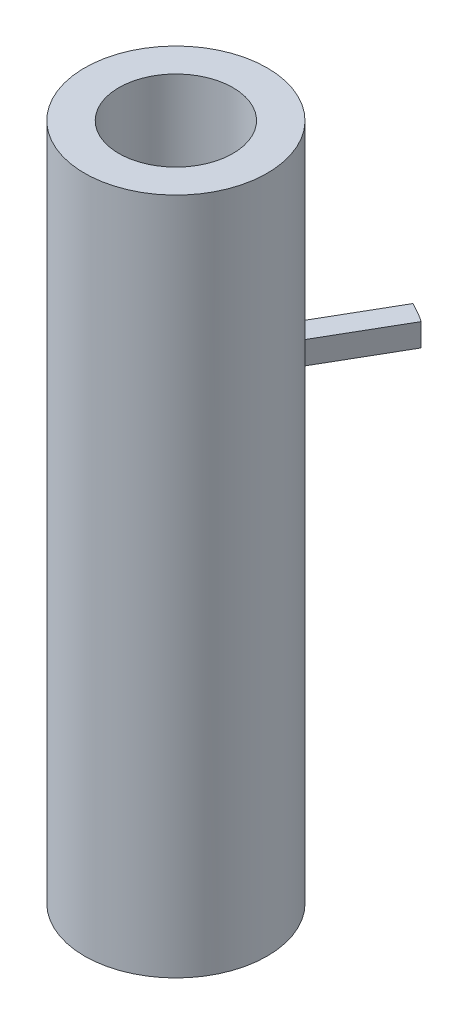
ISO-10303-21;
HEADER;
FILE_DESCRIPTION(('STEP AP214'),'2;1');
FILE_NAME('part.step','',(''),(''),'','','');
FILE_SCHEMA(('AUTOMOTIVE_DESIGN { 1 0 10303 214 1 1 1 1 }'));
ENDSEC;
DATA;
#1=APPLICATION_CONTEXT('core data for automotive mechanical design processes');
#2=APPLICATION_PROTOCOL_DEFINITION('international standard','automotive_design',2000,#1);
#3=PRODUCT_CONTEXT('',#1,'mechanical');
#4=PRODUCT('Part','Part','',(#3));
#5=PRODUCT_RELATED_PRODUCT_CATEGORY('part','',(#4));
#6=PRODUCT_DEFINITION_FORMATION('','',#4);
#7=PRODUCT_DEFINITION_CONTEXT('part definition',#1,'design');
#8=PRODUCT_DEFINITION('design','',#6,#7);
#9=PRODUCT_DEFINITION_SHAPE('','',#8);
#10=(LENGTH_UNIT() NAMED_UNIT(*) SI_UNIT(.MILLI.,.METRE.));
#11=(NAMED_UNIT(*) PLANE_ANGLE_UNIT() SI_UNIT($,.RADIAN.));
#12=(NAMED_UNIT(*) SI_UNIT($,.STERADIAN.) SOLID_ANGLE_UNIT());
#13=UNCERTAINTY_MEASURE_WITH_UNIT(LENGTH_MEASURE(1.E-05),#10,'distance_accuracy_value','');
#14=(GEOMETRIC_REPRESENTATION_CONTEXT(3) GLOBAL_UNCERTAINTY_ASSIGNED_CONTEXT((#13)) GLOBAL_UNIT_ASSIGNED_CONTEXT((#10,
#11,#12)) REPRESENTATION_CONTEXT('',''));
#15=CARTESIAN_POINT('',(0.,0.,0.));
#16=DIRECTION('',(0.,0.,1.));
#17=DIRECTION('',(1.,0.,0.));
#18=AXIS2_PLACEMENT_3D('',#15,#16,#17);
#19=CARTESIAN_POINT('',(0.,133.025671392922,147.930368068259));
#20=DIRECTION('',(0.,-1.,0.));
#21=DIRECTION('',(0.,0.,-1.));
#22=AXIS2_PLACEMENT_3D('',#19,#20,#21);
#23=CYLINDRICAL_SURFACE('',#22,8.00000000000001);
#24=CARTESIAN_POINT('',(0.,50.9999999999999,147.930368068259));
#25=DIRECTION('',(0.,1.,0.));
#26=DIRECTION('',(0.,0.,1.));
#27=AXIS2_PLACEMENT_3D('',#24,#25,#26);
#28=CIRCLE('',#27,8.00000000000001);
#29=CARTESIAN_POINT('',(0.,50.9999999999999,155.930368068259));
#30=VERTEX_POINT('',#29);
#31=EDGE_CURVE('E118',#30,#30,#28,.F.);
#32=ORIENTED_EDGE('',*,*,#31,.F.);
#33=EDGE_LOOP('',(#32));
#34=FACE_BOUND('',#33,.T.);
#35=CARTESIAN_POINT('',(0.,110.398254394953,147.930368068259));
#36=DIRECTION('',(0.,-1.,0.));
#37=DIRECTION('',(0.,0.,-1.));
#38=AXIS2_PLACEMENT_3D('',#35,#36,#37);
#39=CIRCLE('',#38,8.00000000000001);
#40=CARTESIAN_POINT('',(0.,110.398254394953,139.930368068259));
#41=VERTEX_POINT('',#40);
#42=EDGE_CURVE('E49',#41,#41,#39,.T.);
#43=ORIENTED_EDGE('',*,*,#42,.T.);
#44=EDGE_LOOP('',(#43));
#45=FACE_BOUND('',#44,.T.);
#46=CARTESIAN_POINT('',(0.,90.9999999999999,147.930368068259));
#47=DIRECTION('',(0.,-1.,0.));
#48=DIRECTION('',(0.,0.,1.));
#49=AXIS2_PLACEMENT_3D('',#46,#47,#48);
#50=CIRCLE('',#49,8.00000000000001);
#51=CARTESIAN_POINT('',(3.10260156281245,90.9999999999999,140.556504525825));
#52=VERTEX_POINT('',#51);
#53=CARTESIAN_POINT('',(4.83465237038133,90.9999999999999,141.556504525825));
#54=VERTEX_POINT('',#53);
#55=EDGE_CURVE('E65',#52,#54,#50,.T.);
#56=ORIENTED_EDGE('',*,*,#55,.T.);
#57=DIRECTION('',(0.,1.,0.));
#58=VECTOR('',#57,1.);
#59=CARTESIAN_POINT('',(4.83465237038133,90.9999999999999,141.556504525825));
#60=LINE('',#59,#58);
#61=CARTESIAN_POINT('',(4.83465237038133,92.9999999999999,141.556504525825));
#62=VERTEX_POINT('',#61);
#63=EDGE_CURVE('E89',#54,#62,#60,.T.);
#64=ORIENTED_EDGE('',*,*,#63,.T.);
#65=CARTESIAN_POINT('',(0.,92.9999999999999,147.930368068259));
#66=DIRECTION('',(0.,-1.,0.));
#67=DIRECTION('',(0.,0.,1.));
#68=AXIS2_PLACEMENT_3D('',#65,#66,#67);
#69=CIRCLE('',#68,8.00000000000001);
#70=CARTESIAN_POINT('',(3.10260156281244,92.9999999999999,140.556504525825));
#71=VERTEX_POINT('',#70);
#72=EDGE_CURVE('E107',#71,#62,#69,.T.);
#73=ORIENTED_EDGE('',*,*,#72,.F.);
#74=DIRECTION('',(0.,1.,0.));
#75=VECTOR('',#74,1.);
#76=CARTESIAN_POINT('',(3.10260156281245,90.9999999999999,140.556504525825));
#77=LINE('',#76,#75);
#78=EDGE_CURVE('E113',#52,#71,#77,.T.);
#79=ORIENTED_EDGE('',*,*,#78,.F.);
#80=EDGE_LOOP('',(#56,#64,#73,#79));
#81=FACE_BOUND('',#80,.T.);
#82=ADVANCED_FACE('F41',(#34,#45,#81),#23,.T.);
#83=CARTESIAN_POINT('',(0.,133.025671392922,147.930368068259));
#84=DIRECTION('',(0.,-1.,0.));
#85=DIRECTION('',(0.,0.,-1.));
#86=AXIS2_PLACEMENT_3D('',#83,#84,#85);
#87=CYLINDRICAL_SURFACE('',#86,5.00000000000001);
#88=CARTESIAN_POINT('',(0.,110.398254394953,147.930368068259));
#89=DIRECTION('',(0.,-1.,0.));
#90=DIRECTION('',(0.,0.,-1.));
#91=AXIS2_PLACEMENT_3D('',#88,#89,#90);
#92=CIRCLE('',#91,5.00000000000001);
#93=CARTESIAN_POINT('',(0.,110.398254394953,142.930368068259));
#94=VERTEX_POINT('',#93);
#95=EDGE_CURVE('E11',#94,#94,#92,.T.);
#96=ORIENTED_EDGE('',*,*,#95,.F.);
#97=EDGE_LOOP('',(#96));
#98=FACE_BOUND('',#97,.T.);
#99=CARTESIAN_POINT('',(0.,50.9999999999999,147.930368068259));
#100=DIRECTION('',(0.,1.,0.));
#101=DIRECTION('',(0.,0.,1.));
#102=AXIS2_PLACEMENT_3D('',#99,#100,#101);
#103=CIRCLE('',#102,5.00000000000001);
#104=CARTESIAN_POINT('',(0.,50.9999999999999,152.930368068259));
#105=VERTEX_POINT('',#104);
#106=EDGE_CURVE('E115',#105,#105,#103,.F.);
#107=ORIENTED_EDGE('',*,*,#106,.T.);
#108=EDGE_LOOP('',(#107));
#109=FACE_BOUND('',#108,.T.);
#110=ADVANCED_FACE('F129',(#98,#109),#87,.F.);
#111=CARTESIAN_POINT('',(-27.0843529470057,110.398254394953,165.430368068259));
#112=DIRECTION('',(0.,-1.,0.));
#113=DIRECTION('',(0.,0.,-1.));
#114=AXIS2_PLACEMENT_3D('',#111,#112,#113);
#115=PLANE('',#114);
#116=ORIENTED_EDGE('',*,*,#95,.T.);
#117=EDGE_LOOP('',(#116));
#118=FACE_BOUND('',#117,.T.);
#119=ORIENTED_EDGE('',*,*,#42,.F.);
#120=EDGE_LOOP('',(#119));
#121=FACE_BOUND('',#120,.T.);
#122=ADVANCED_FACE('F43',(#118,#121),#115,.F.);
#123=CARTESIAN_POINT('',(-27.0843529470057,50.9999999999999,131.467168455346));
#124=DIRECTION('',(0.,1.,0.));
#125=DIRECTION('',(0.,0.,1.));
#126=AXIS2_PLACEMENT_3D('',#123,#124,#125);
#127=PLANE('',#126);
#128=ORIENTED_EDGE('',*,*,#31,.T.);
#129=EDGE_LOOP('',(#128));
#130=FACE_BOUND('',#129,.T.);
#131=ORIENTED_EDGE('',*,*,#106,.F.);
#132=EDGE_LOOP('',(#131));
#133=FACE_BOUND('',#132,.T.);
#134=ADVANCED_FACE('F128',(#130,#133),#127,.F.);
#135=CARTESIAN_POINT('',(3.10260156281245,90.9999999999999,140.556504525825));
#136=DIRECTION('',(-0.866025403784438,0.,-0.500000000000001));
#137=DIRECTION('',(-0.500000000000001,0.,0.866025403784438));
#138=AXIS2_PLACEMENT_3D('',#135,#136,#137);
#139=PLANE('',#138);
#140=DIRECTION('',(-0.500000000000001,0.,0.866025403784438));
#141=VECTOR('',#140,1.);
#142=CARTESIAN_POINT('',(3.10260156281245,92.9999999999999,140.556504525825));
#143=LINE('',#142,#141);
#144=CARTESIAN_POINT('',(6.86782874534458,92.9999999999999,134.03493974364));
#145=VERTEX_POINT('',#144);
#146=EDGE_CURVE('E56',#145,#71,#143,.T.);
#147=ORIENTED_EDGE('',*,*,#146,.F.);
#148=DIRECTION('',(0.,1.,0.));
#149=VECTOR('',#148,1.);
#150=CARTESIAN_POINT('',(6.86782874534458,90.9999999999999,134.03493974364));
#151=LINE('',#150,#149);
#152=CARTESIAN_POINT('',(6.86782874534458,90.9999999999999,134.03493974364));
#153=VERTEX_POINT('',#152);
#154=EDGE_CURVE('E83',#153,#145,#151,.T.);
#155=ORIENTED_EDGE('',*,*,#154,.F.);
#156=DIRECTION('',(-0.500000000000001,0.,0.866025403784438));
#157=VECTOR('',#156,1.);
#158=CARTESIAN_POINT('',(3.10260156281245,90.9999999999999,140.556504525825));
#159=LINE('',#158,#157);
#160=EDGE_CURVE('E100',#153,#52,#159,.T.);
#161=ORIENTED_EDGE('',*,*,#160,.T.);
#162=ORIENTED_EDGE('',*,*,#78,.T.);
#163=EDGE_LOOP('',(#147,#155,#161,#162));
#164=FACE_BOUND('',#163,.T.);
#165=ADVANCED_FACE('F136',(#164),#139,.T.);
#166=CARTESIAN_POINT('',(0.,90.9999999999999,147.930368068259));
#167=DIRECTION('',(0.,1.,0.));
#168=DIRECTION('',(0.,0.,1.));
#169=AXIS2_PLACEMENT_3D('',#166,#167,#168);
#170=CYLINDRICAL_SURFACE('',#169,15.5);
#171=CARTESIAN_POINT('',(0.,92.9999999999999,147.930368068259));
#172=DIRECTION('',(0.,1.,0.));
#173=DIRECTION('',(0.,0.,1.));
#174=AXIS2_PLACEMENT_3D('',#171,#172,#173);
#175=CIRCLE('',#174,15.5);
#176=CARTESIAN_POINT('',(8.59987955291346,92.9999999999999,135.03493974364));
#177=VERTEX_POINT('',#176);
#178=EDGE_CURVE('E95',#177,#145,#175,.T.);
#179=ORIENTED_EDGE('',*,*,#178,.F.);
#180=DIRECTION('',(0.,1.,0.));
#181=VECTOR('',#180,1.);
#182=CARTESIAN_POINT('',(8.59987955291346,90.9999999999999,135.03493974364));
#183=LINE('',#182,#181);
#184=CARTESIAN_POINT('',(8.59987955291346,90.9999999999999,135.03493974364));
#185=VERTEX_POINT('',#184);
#186=EDGE_CURVE('E91',#185,#177,#183,.T.);
#187=ORIENTED_EDGE('',*,*,#186,.F.);
#188=CARTESIAN_POINT('',(0.,90.9999999999999,147.930368068259));
#189=DIRECTION('',(0.,1.,0.));
#190=DIRECTION('',(0.,0.,1.));
#191=AXIS2_PLACEMENT_3D('',#188,#189,#190);
#192=CIRCLE('',#191,15.5);
#193=EDGE_CURVE('E94',#185,#153,#192,.T.);
#194=ORIENTED_EDGE('',*,*,#193,.T.);
#195=ORIENTED_EDGE('',*,*,#154,.T.);
#196=EDGE_LOOP('',(#179,#187,#194,#195));
#197=FACE_BOUND('',#196,.T.);
#198=ADVANCED_FACE('F93',(#197),#170,.T.);
#199=CARTESIAN_POINT('',(4.83465237038133,90.9999999999999,141.556504525825));
#200=DIRECTION('',(0.866025403784438,0.,0.5));
#201=DIRECTION('',(0.5,0.,-0.866025403784438));
#202=AXIS2_PLACEMENT_3D('',#199,#200,#201);
#203=PLANE('',#202);
#204=DIRECTION('',(0.5,0.,-0.866025403784438));
#205=VECTOR('',#204,1.);
#206=CARTESIAN_POINT('',(4.83465237038133,92.9999999999999,141.556504525825));
#207=LINE('',#206,#205);
#208=EDGE_CURVE('E109',#62,#177,#207,.T.);
#209=ORIENTED_EDGE('',*,*,#208,.F.);
#210=ORIENTED_EDGE('',*,*,#63,.F.);
#211=DIRECTION('',(0.5,0.,-0.866025403784438));
#212=VECTOR('',#211,1.);
#213=CARTESIAN_POINT('',(4.83465237038133,90.9999999999999,141.556504525825));
#214=LINE('',#213,#212);
#215=EDGE_CURVE('E99',#54,#185,#214,.T.);
#216=ORIENTED_EDGE('',*,*,#215,.T.);
#217=ORIENTED_EDGE('',*,*,#186,.T.);
#218=EDGE_LOOP('',(#209,#210,#216,#217));
#219=FACE_BOUND('',#218,.T.);
#220=ADVANCED_FACE('F102',(#219),#203,.T.);
#221=CARTESIAN_POINT('',(0.,90.9999999999999,147.930368068259));
#222=DIRECTION('',(0.,1.,0.));
#223=DIRECTION('',(0.,0.,1.));
#224=AXIS2_PLACEMENT_3D('',#221,#222,#223);
#225=PLANE('',#224);
#226=ORIENTED_EDGE('',*,*,#55,.F.);
#227=ORIENTED_EDGE('',*,*,#160,.F.);
#228=ORIENTED_EDGE('',*,*,#193,.F.);
#229=ORIENTED_EDGE('',*,*,#215,.F.);
#230=EDGE_LOOP('',(#226,#227,#228,#229));
#231=FACE_BOUND('',#230,.T.);
#232=ADVANCED_FACE('F98',(#231),#225,.F.);
#233=CARTESIAN_POINT('',(0.,92.9999999999999,147.930368068259));
#234=DIRECTION('',(0.,1.,0.));
#235=DIRECTION('',(0.,0.,1.));
#236=AXIS2_PLACEMENT_3D('',#233,#234,#235);
#237=PLANE('',#236);
#238=ORIENTED_EDGE('',*,*,#72,.T.);
#239=ORIENTED_EDGE('',*,*,#208,.T.);
#240=ORIENTED_EDGE('',*,*,#178,.T.);
#241=ORIENTED_EDGE('',*,*,#146,.T.);
#242=EDGE_LOOP('',(#238,#239,#240,#241));
#243=FACE_BOUND('',#242,.T.);
#244=ADVANCED_FACE('F155',(#243),#237,.T.);
#245=CLOSED_SHELL('',(#82,#110,#122,#134,#165,#198,#220,#232,#244));
#246=MANIFOLD_SOLID_BREP('B2',#245);
#247=ADVANCED_BREP_SHAPE_REPRESENTATION('',(#18,#246),#14);
#248=SHAPE_DEFINITION_REPRESENTATION(#9,#247);
ENDSEC;
END-ISO-10303-21;
